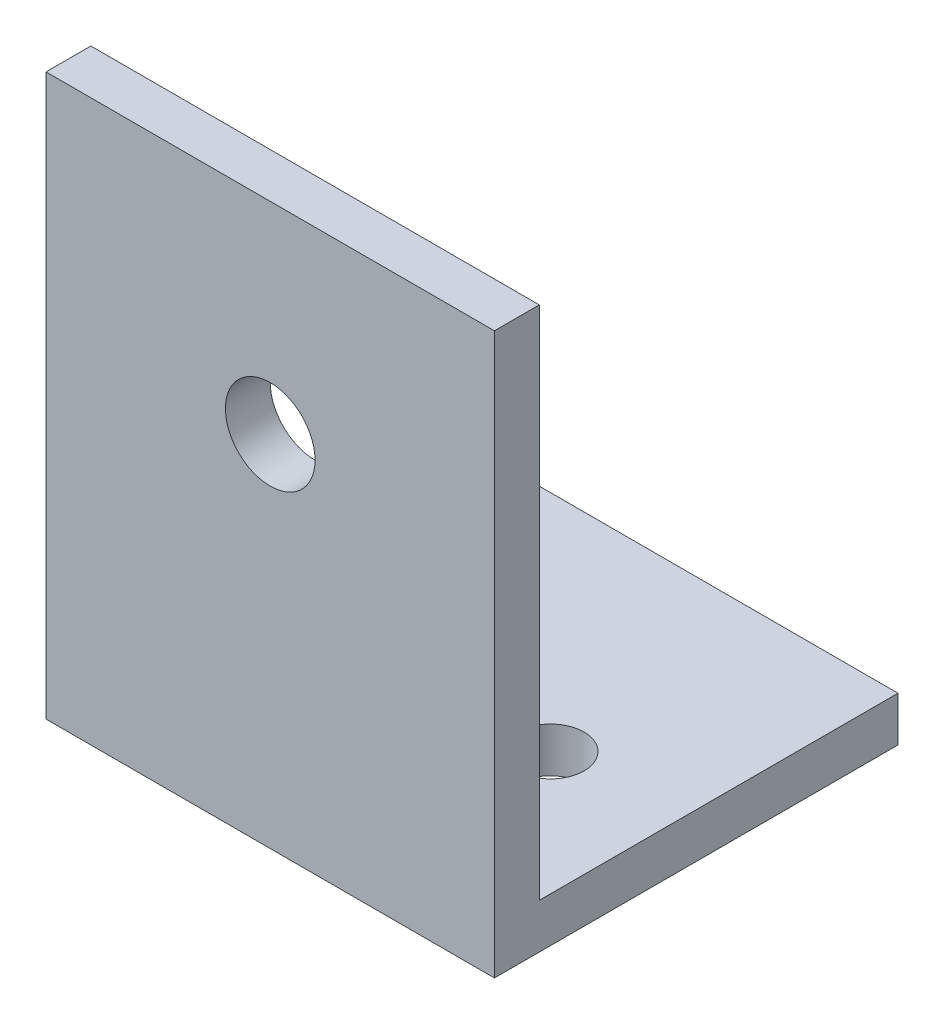
ISO-10303-21;
HEADER;
FILE_DESCRIPTION(('STEP AP214'),'2;1');
FILE_NAME('part.step','',(''),(''),'','','');
FILE_SCHEMA(('AUTOMOTIVE_DESIGN { 1 0 10303 214 1 1 1 1 }'));
ENDSEC;
DATA;
#1=APPLICATION_CONTEXT('core data for automotive mechanical design processes');
#2=APPLICATION_PROTOCOL_DEFINITION('international standard','automotive_design',2000,#1);
#3=PRODUCT_CONTEXT('',#1,'mechanical');
#4=PRODUCT('Part','Part','',(#3));
#5=PRODUCT_RELATED_PRODUCT_CATEGORY('part','',(#4));
#6=PRODUCT_DEFINITION_FORMATION('','',#4);
#7=PRODUCT_DEFINITION_CONTEXT('part definition',#1,'design');
#8=PRODUCT_DEFINITION('design','',#6,#7);
#9=PRODUCT_DEFINITION_SHAPE('','',#8);
#10=(LENGTH_UNIT() NAMED_UNIT(*) SI_UNIT(.MILLI.,.METRE.));
#11=(NAMED_UNIT(*) PLANE_ANGLE_UNIT() SI_UNIT($,.RADIAN.));
#12=(NAMED_UNIT(*) SI_UNIT($,.STERADIAN.) SOLID_ANGLE_UNIT());
#13=UNCERTAINTY_MEASURE_WITH_UNIT(LENGTH_MEASURE(1.E-05),#10,'distance_accuracy_value','');
#14=(GEOMETRIC_REPRESENTATION_CONTEXT(3) GLOBAL_UNCERTAINTY_ASSIGNED_CONTEXT((#13)) GLOBAL_UNIT_ASSIGNED_CONTEXT((#10,
#11,#12)) REPRESENTATION_CONTEXT('',''));
#15=CARTESIAN_POINT('',(0.,0.,0.));
#16=DIRECTION('',(0.,0.,1.));
#17=DIRECTION('',(1.,0.,0.));
#18=AXIS2_PLACEMENT_3D('',#15,#16,#17);
#19=CARTESIAN_POINT('',(20.,3.,-18.));
#20=DIRECTION('',(0.,0.,1.));
#21=DIRECTION('',(0.,-1.,0.));
#22=AXIS2_PLACEMENT_3D('',#19,#20,#21);
#23=PLANE('',#22);
#24=DIRECTION('',(-1.,0.,0.));
#25=VECTOR('',#24,1.);
#26=CARTESIAN_POINT('',(0.,2.,-18.));
#27=LINE('',#26,#25);
#28=CARTESIAN_POINT('',(20.,2.,-18.));
#29=VERTEX_POINT('',#28);
#30=CARTESIAN_POINT('',(0.,2.,-18.));
#31=VERTEX_POINT('',#30);
#32=EDGE_CURVE('E50',#29,#31,#27,.T.);
#33=ORIENTED_EDGE('',*,*,#32,.F.);
#34=DIRECTION('',(0.,1.,0.));
#35=VECTOR('',#34,1.);
#36=CARTESIAN_POINT('',(20.,3.,-18.));
#37=LINE('',#36,#35);
#38=CARTESIAN_POINT('',(20.,0.,-18.));
#39=VERTEX_POINT('',#38);
#40=EDGE_CURVE('E81',#39,#29,#37,.T.);
#41=ORIENTED_EDGE('',*,*,#40,.F.);
#42=DIRECTION('',(-1.,0.,0.));
#43=VECTOR('',#42,1.);
#44=CARTESIAN_POINT('',(20.,0.,-18.));
#45=LINE('',#44,#43);
#46=CARTESIAN_POINT('',(0.,0.,-18.));
#47=VERTEX_POINT('',#46);
#48=EDGE_CURVE('E11',#39,#47,#45,.T.);
#49=ORIENTED_EDGE('',*,*,#48,.T.);
#50=DIRECTION('',(0.,1.,0.));
#51=VECTOR('',#50,1.);
#52=CARTESIAN_POINT('',(0.,3.,-18.));
#53=LINE('',#52,#51);
#54=EDGE_CURVE('E119',#47,#31,#53,.T.);
#55=ORIENTED_EDGE('',*,*,#54,.T.);
#56=EDGE_LOOP('',(#33,#41,#49,#55));
#57=FACE_BOUND('',#56,.T.);
#58=ADVANCED_FACE('F33',(#57),#23,.F.);
#59=CARTESIAN_POINT('',(5.5,0.,-8.));
#60=DIRECTION('',(0.,1.,0.));
#61=DIRECTION('',(0.,0.,1.));
#62=AXIS2_PLACEMENT_3D('',#59,#60,#61);
#63=CYLINDRICAL_SURFACE('',#62,1.5);
#64=CARTESIAN_POINT('',(5.5,0.,-8.));
#65=DIRECTION('',(0.,1.,0.));
#66=DIRECTION('',(0.,0.,1.));
#67=AXIS2_PLACEMENT_3D('',#64,#65,#66);
#68=CIRCLE('',#67,1.5);
#69=CARTESIAN_POINT('',(5.5,0.,-6.5));
#70=VERTEX_POINT('',#69);
#71=EDGE_CURVE('E149',#70,#70,#68,.T.);
#72=ORIENTED_EDGE('',*,*,#71,.F.);
#73=EDGE_LOOP('',(#72));
#74=FACE_BOUND('',#73,.T.);
#75=CARTESIAN_POINT('',(5.5,2.,-8.));
#76=DIRECTION('',(0.,1.,0.));
#77=DIRECTION('',(0.,0.,1.));
#78=AXIS2_PLACEMENT_3D('',#75,#76,#77);
#79=CIRCLE('',#78,1.5);
#80=CARTESIAN_POINT('',(5.5,2.,-6.5));
#81=VERTEX_POINT('',#80);
#82=EDGE_CURVE('E132',#81,#81,#79,.F.);
#83=ORIENTED_EDGE('',*,*,#82,.F.);
#84=EDGE_LOOP('',(#83));
#85=FACE_BOUND('',#84,.T.);
#86=ADVANCED_FACE('F160',(#74,#85),#63,.F.);
#87=CARTESIAN_POINT('',(14.5,0.,-8.));
#88=DIRECTION('',(0.,1.,0.));
#89=DIRECTION('',(0.,0.,1.));
#90=AXIS2_PLACEMENT_3D('',#87,#88,#89);
#91=CYLINDRICAL_SURFACE('',#90,1.5);
#92=CARTESIAN_POINT('',(14.5,0.,-8.));
#93=DIRECTION('',(0.,1.,0.));
#94=DIRECTION('',(0.,0.,1.));
#95=AXIS2_PLACEMENT_3D('',#92,#93,#94);
#96=CIRCLE('',#95,1.5);
#97=CARTESIAN_POINT('',(14.5,0.,-6.5));
#98=VERTEX_POINT('',#97);
#99=EDGE_CURVE('E146',#98,#98,#96,.T.);
#100=ORIENTED_EDGE('',*,*,#99,.F.);
#101=EDGE_LOOP('',(#100));
#102=FACE_BOUND('',#101,.T.);
#103=CARTESIAN_POINT('',(14.5,2.,-8.));
#104=DIRECTION('',(0.,1.,0.));
#105=DIRECTION('',(0.,0.,1.));
#106=AXIS2_PLACEMENT_3D('',#103,#104,#105);
#107=CIRCLE('',#106,1.5);
#108=CARTESIAN_POINT('',(14.5,2.,-6.5));
#109=VERTEX_POINT('',#108);
#110=EDGE_CURVE('E130',#109,#109,#107,.F.);
#111=ORIENTED_EDGE('',*,*,#110,.F.);
#112=EDGE_LOOP('',(#111));
#113=FACE_BOUND('',#112,.T.);
#114=ADVANCED_FACE('F164',(#102,#113),#91,.F.);
#115=CARTESIAN_POINT('',(20.,0.,-18.));
#116=DIRECTION('',(0.,1.,0.));
#117=DIRECTION('',(0.,0.,1.));
#118=AXIS2_PLACEMENT_3D('',#115,#116,#117);
#119=PLANE('',#118);
#120=ORIENTED_EDGE('',*,*,#99,.T.);
#121=EDGE_LOOP('',(#120));
#122=FACE_BOUND('',#121,.T.);
#123=ORIENTED_EDGE('',*,*,#71,.T.);
#124=EDGE_LOOP('',(#123));
#125=FACE_BOUND('',#124,.T.);
#126=DIRECTION('',(0.,0.,-1.));
#127=VECTOR('',#126,1.);
#128=CARTESIAN_POINT('',(0.,0.,-18.));
#129=LINE('',#128,#127);
#130=CARTESIAN_POINT('',(0.,0.,0.));
#131=VERTEX_POINT('',#130);
#132=EDGE_CURVE('E124',#131,#47,#129,.T.);
#133=ORIENTED_EDGE('',*,*,#132,.T.);
#134=ORIENTED_EDGE('',*,*,#48,.F.);
#135=DIRECTION('',(0.,0.,-1.));
#136=VECTOR('',#135,1.);
#137=CARTESIAN_POINT('',(20.,0.,-18.));
#138=LINE('',#137,#136);
#139=CARTESIAN_POINT('',(20.,0.,0.));
#140=VERTEX_POINT('',#139);
#141=EDGE_CURVE('E121',#140,#39,#138,.T.);
#142=ORIENTED_EDGE('',*,*,#141,.F.);
#143=DIRECTION('',(-1.,0.,0.));
#144=VECTOR('',#143,1.);
#145=CARTESIAN_POINT('',(20.,0.,0.));
#146=LINE('',#145,#144);
#147=EDGE_CURVE('E128',#140,#131,#146,.T.);
#148=ORIENTED_EDGE('',*,*,#147,.T.);
#149=EDGE_LOOP('',(#133,#134,#142,#148));
#150=FACE_BOUND('',#149,.T.);
#151=ADVANCED_FACE('F35',(#122,#125,#150),#119,.F.);
#152=CARTESIAN_POINT('',(20.,25.,0.));
#153=DIRECTION('',(0.,-1.,0.));
#154=DIRECTION('',(0.,0.,-1.));
#155=AXIS2_PLACEMENT_3D('',#152,#153,#154);
#156=PLANE('',#155);
#157=DIRECTION('',(0.,0.,1.));
#158=VECTOR('',#157,1.);
#159=CARTESIAN_POINT('',(20.,25.,0.));
#160=LINE('',#159,#158);
#161=CARTESIAN_POINT('',(20.,25.,-2.));
#162=VERTEX_POINT('',#161);
#163=CARTESIAN_POINT('',(20.,25.,0.));
#164=VERTEX_POINT('',#163);
#165=EDGE_CURVE('E114',#162,#164,#160,.T.);
#166=ORIENTED_EDGE('',*,*,#165,.F.);
#167=DIRECTION('',(1.,0.,0.));
#168=VECTOR('',#167,1.);
#169=CARTESIAN_POINT('',(0.,25.,-2.));
#170=LINE('',#169,#168);
#171=CARTESIAN_POINT('',(0.,25.,-2.));
#172=VERTEX_POINT('',#171);
#173=EDGE_CURVE('E102',#172,#162,#170,.T.);
#174=ORIENTED_EDGE('',*,*,#173,.F.);
#175=DIRECTION('',(0.,0.,1.));
#176=VECTOR('',#175,1.);
#177=CARTESIAN_POINT('',(0.,25.,0.));
#178=LINE('',#177,#176);
#179=CARTESIAN_POINT('',(0.,25.,0.));
#180=VERTEX_POINT('',#179);
#181=EDGE_CURVE('E113',#172,#180,#178,.T.);
#182=ORIENTED_EDGE('',*,*,#181,.T.);
#183=DIRECTION('',(-1.,0.,0.));
#184=VECTOR('',#183,1.);
#185=CARTESIAN_POINT('',(20.,25.,0.));
#186=LINE('',#185,#184);
#187=EDGE_CURVE('E42',#164,#180,#186,.T.);
#188=ORIENTED_EDGE('',*,*,#187,.F.);
#189=EDGE_LOOP('',(#166,#174,#182,#188));
#190=FACE_BOUND('',#189,.T.);
#191=ADVANCED_FACE('F111',(#190),#156,.F.);
#192=CARTESIAN_POINT('',(20.,0.,0.));
#193=DIRECTION('',(0.,0.,-1.));
#194=DIRECTION('',(-1.,0.,0.));
#195=AXIS2_PLACEMENT_3D('',#192,#193,#194);
#196=PLANE('',#195);
#197=CARTESIAN_POINT('',(10.,16.,0.));
#198=DIRECTION('',(0.,0.,1.));
#199=DIRECTION('',(1.,0.,0.));
#200=AXIS2_PLACEMENT_3D('',#197,#198,#199);
#201=CIRCLE('',#200,2.);
#202=CARTESIAN_POINT('',(12.,16.,0.));
#203=VERTEX_POINT('',#202);
#204=EDGE_CURVE('E136',#203,#203,#201,.T.);
#205=ORIENTED_EDGE('',*,*,#204,.F.);
#206=EDGE_LOOP('',(#205));
#207=FACE_BOUND('',#206,.T.);
#208=DIRECTION('',(0.,-1.,0.));
#209=VECTOR('',#208,1.);
#210=CARTESIAN_POINT('',(0.,0.,0.));
#211=LINE('',#210,#209);
#212=EDGE_CURVE('E76',#180,#131,#211,.T.);
#213=ORIENTED_EDGE('',*,*,#212,.T.);
#214=ORIENTED_EDGE('',*,*,#147,.F.);
#215=DIRECTION('',(0.,-1.,0.));
#216=VECTOR('',#215,1.);
#217=CARTESIAN_POINT('',(20.,0.,0.));
#218=LINE('',#217,#216);
#219=EDGE_CURVE('E59',#164,#140,#218,.T.);
#220=ORIENTED_EDGE('',*,*,#219,.F.);
#221=ORIENTED_EDGE('',*,*,#187,.T.);
#222=EDGE_LOOP('',(#213,#214,#220,#221));
#223=FACE_BOUND('',#222,.T.);
#224=ADVANCED_FACE('F170',(#207,#223),#196,.F.);
#225=CARTESIAN_POINT('',(20.,0.,0.));
#226=DIRECTION('',(-1.,0.,0.));
#227=DIRECTION('',(0.,0.,1.));
#228=AXIS2_PLACEMENT_3D('',#225,#226,#227);
#229=PLANE('',#228);
#230=DIRECTION('',(0.,0.,-1.));
#231=VECTOR('',#230,1.);
#232=CARTESIAN_POINT('',(20.,2.,-18.));
#233=LINE('',#232,#231);
#234=CARTESIAN_POINT('',(20.,2.,-2.));
#235=VERTEX_POINT('',#234);
#236=EDGE_CURVE('E138',#235,#29,#233,.T.);
#237=ORIENTED_EDGE('',*,*,#236,.F.);
#238=DIRECTION('',(0.,-1.,0.));
#239=VECTOR('',#238,1.);
#240=CARTESIAN_POINT('',(20.,25.,-2.));
#241=LINE('',#240,#239);
#242=EDGE_CURVE('E115',#162,#235,#241,.T.);
#243=ORIENTED_EDGE('',*,*,#242,.F.);
#244=ORIENTED_EDGE('',*,*,#165,.T.);
#245=ORIENTED_EDGE('',*,*,#219,.T.);
#246=ORIENTED_EDGE('',*,*,#141,.T.);
#247=ORIENTED_EDGE('',*,*,#40,.T.);
#248=EDGE_LOOP('',(#237,#243,#244,#245,#246,#247));
#249=FACE_BOUND('',#248,.T.);
#250=ADVANCED_FACE('F173',(#249),#229,.F.);
#251=CARTESIAN_POINT('',(0.,0.,0.));
#252=DIRECTION('',(-1.,0.,0.));
#253=DIRECTION('',(0.,0.,1.));
#254=AXIS2_PLACEMENT_3D('',#251,#252,#253);
#255=PLANE('',#254);
#256=DIRECTION('',(0.,1.,0.));
#257=VECTOR('',#256,1.);
#258=CARTESIAN_POINT('',(0.,25.,-2.));
#259=LINE('',#258,#257);
#260=CARTESIAN_POINT('',(0.,2.,-2.));
#261=VERTEX_POINT('',#260);
#262=EDGE_CURVE('E97',#261,#172,#259,.T.);
#263=ORIENTED_EDGE('',*,*,#262,.F.);
#264=DIRECTION('',(0.,0.,1.));
#265=VECTOR('',#264,1.);
#266=CARTESIAN_POINT('',(0.,2.,-18.));
#267=LINE('',#266,#265);
#268=EDGE_CURVE('E140',#31,#261,#267,.T.);
#269=ORIENTED_EDGE('',*,*,#268,.F.);
#270=ORIENTED_EDGE('',*,*,#54,.F.);
#271=ORIENTED_EDGE('',*,*,#132,.F.);
#272=ORIENTED_EDGE('',*,*,#212,.F.);
#273=ORIENTED_EDGE('',*,*,#181,.F.);
#274=EDGE_LOOP('',(#263,#269,#270,#271,#272,#273));
#275=FACE_BOUND('',#274,.T.);
#276=ADVANCED_FACE('F117',(#275),#255,.T.);
#277=CARTESIAN_POINT('',(10.,16.,-18.));
#278=DIRECTION('',(0.,0.,1.));
#279=DIRECTION('',(1.,0.,0.));
#280=AXIS2_PLACEMENT_3D('',#277,#278,#279);
#281=CYLINDRICAL_SURFACE('',#280,2.);
#282=CARTESIAN_POINT('',(10.,16.,-2.));
#283=DIRECTION('',(0.,0.,1.));
#284=DIRECTION('',(0.,-1.,0.));
#285=AXIS2_PLACEMENT_3D('',#282,#283,#284);
#286=CIRCLE('',#285,2.);
#287=CARTESIAN_POINT('',(10.,14.,-2.));
#288=VERTEX_POINT('',#287);
#289=EDGE_CURVE('E37',#288,#288,#286,.F.);
#290=ORIENTED_EDGE('',*,*,#289,.T.);
#291=EDGE_LOOP('',(#290));
#292=FACE_BOUND('',#291,.T.);
#293=ORIENTED_EDGE('',*,*,#204,.T.);
#294=EDGE_LOOP('',(#293));
#295=FACE_BOUND('',#294,.T.);
#296=ADVANCED_FACE('F177',(#292,#295),#281,.F.);
#297=CARTESIAN_POINT('',(0.,2.,0.));
#298=DIRECTION('',(0.,1.,0.));
#299=DIRECTION('',(0.,0.,1.));
#300=AXIS2_PLACEMENT_3D('',#297,#298,#299);
#301=PLANE('',#300);
#302=ORIENTED_EDGE('',*,*,#268,.T.);
#303=DIRECTION('',(-1.,0.,0.));
#304=VECTOR('',#303,1.);
#305=CARTESIAN_POINT('',(0.,2.,-2.));
#306=LINE('',#305,#304);
#307=EDGE_CURVE('E105',#235,#261,#306,.T.);
#308=ORIENTED_EDGE('',*,*,#307,.F.);
#309=ORIENTED_EDGE('',*,*,#236,.T.);
#310=ORIENTED_EDGE('',*,*,#32,.T.);
#311=EDGE_LOOP('',(#302,#308,#309,#310));
#312=FACE_BOUND('',#311,.T.);
#313=ORIENTED_EDGE('',*,*,#110,.T.);
#314=EDGE_LOOP('',(#313));
#315=FACE_BOUND('',#314,.T.);
#316=ORIENTED_EDGE('',*,*,#82,.T.);
#317=EDGE_LOOP('',(#316));
#318=FACE_BOUND('',#317,.T.);
#319=ADVANCED_FACE('F185',(#312,#315,#318),#301,.T.);
#320=CARTESIAN_POINT('',(0.,0.,-2.));
#321=DIRECTION('',(0.,0.,1.));
#322=DIRECTION('',(0.,-1.,0.));
#323=AXIS2_PLACEMENT_3D('',#320,#321,#322);
#324=PLANE('',#323);
#325=ORIENTED_EDGE('',*,*,#262,.T.);
#326=ORIENTED_EDGE('',*,*,#173,.T.);
#327=ORIENTED_EDGE('',*,*,#242,.T.);
#328=ORIENTED_EDGE('',*,*,#307,.T.);
#329=EDGE_LOOP('',(#325,#326,#327,#328));
#330=FACE_BOUND('',#329,.T.);
#331=ORIENTED_EDGE('',*,*,#289,.F.);
#332=EDGE_LOOP('',(#331));
#333=FACE_BOUND('',#332,.T.);
#334=ADVANCED_FACE('F99',(#330,#333),#324,.F.);
#335=CLOSED_SHELL('',(#58,#86,#114,#151,#191,#224,#250,#276,#296,#319,#334));
#336=MANIFOLD_SOLID_BREP('B2',#335);
#337=ADVANCED_BREP_SHAPE_REPRESENTATION('',(#18,#336),#14);
#338=SHAPE_DEFINITION_REPRESENTATION(#9,#337);
ENDSEC;
END-ISO-10303-21;
